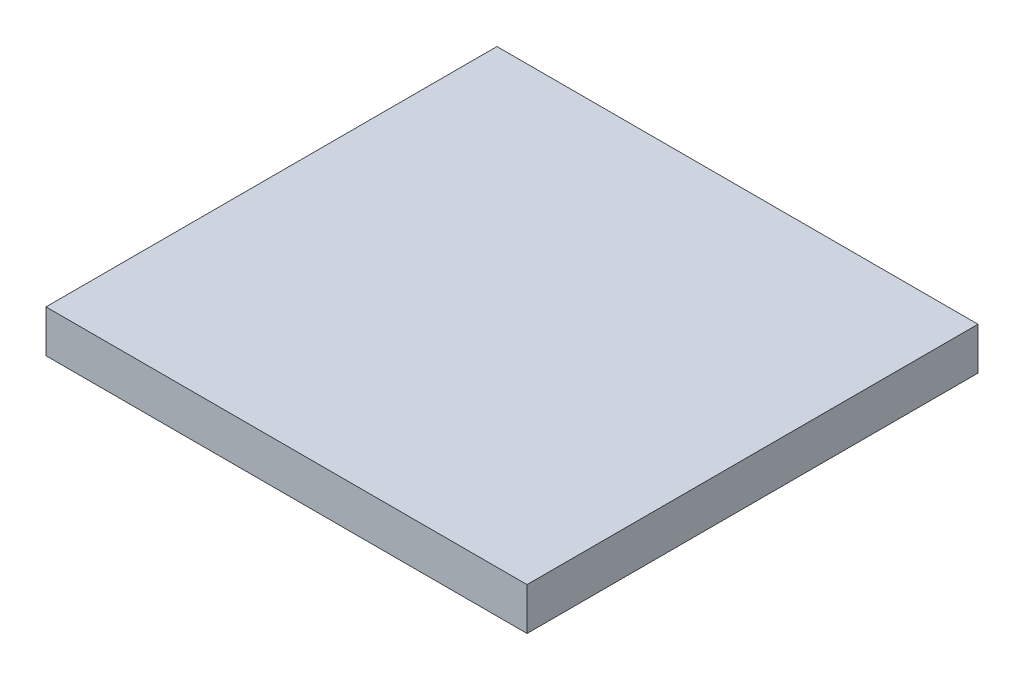
ISO-10303-21;
HEADER;
FILE_DESCRIPTION(('STEP AP214'),'2;1');
FILE_NAME('part.step','',(''),(''),'','','');
FILE_SCHEMA(('AUTOMOTIVE_DESIGN { 1 0 10303 214 1 1 1 1 }'));
ENDSEC;
DATA;
#1=APPLICATION_CONTEXT('core data for automotive mechanical design processes');
#2=APPLICATION_PROTOCOL_DEFINITION('international standard','automotive_design',2000,#1);
#3=PRODUCT_CONTEXT('',#1,'mechanical');
#4=PRODUCT('Part','Part','',(#3));
#5=PRODUCT_RELATED_PRODUCT_CATEGORY('part','',(#4));
#6=PRODUCT_DEFINITION_FORMATION('','',#4);
#7=PRODUCT_DEFINITION_CONTEXT('part definition',#1,'design');
#8=PRODUCT_DEFINITION('design','',#6,#7);
#9=PRODUCT_DEFINITION_SHAPE('','',#8);
#10=(LENGTH_UNIT() NAMED_UNIT(*) SI_UNIT(.MILLI.,.METRE.));
#11=(NAMED_UNIT(*) PLANE_ANGLE_UNIT() SI_UNIT($,.RADIAN.));
#12=(NAMED_UNIT(*) SI_UNIT($,.STERADIAN.) SOLID_ANGLE_UNIT());
#13=UNCERTAINTY_MEASURE_WITH_UNIT(LENGTH_MEASURE(1.E-05),#10,'distance_accuracy_value','');
#14=(GEOMETRIC_REPRESENTATION_CONTEXT(3) GLOBAL_UNCERTAINTY_ASSIGNED_CONTEXT((#13)) GLOBAL_UNIT_ASSIGNED_CONTEXT((#10,
#11,#12)) REPRESENTATION_CONTEXT('',''));
#15=CARTESIAN_POINT('',(0.,0.,0.));
#16=DIRECTION('',(0.,0.,1.));
#17=DIRECTION('',(1.,0.,0.));
#18=AXIS2_PLACEMENT_3D('',#15,#16,#17);
#19=CARTESIAN_POINT('',(-23292.1984011945,5494.86880151477,41169.208590158));
#20=DIRECTION('',(0.,0.,-1.));
#21=DIRECTION('',(-1.,0.,0.));
#22=AXIS2_PLACEMENT_3D('',#19,#20,#21);
#23=PLANE('',#22);
#24=DIRECTION('',(1.,0.,0.));
#25=VECTOR('',#24,1.);
#26=CARTESIAN_POINT('',(-23292.1984011945,5474.86880151477,41169.208590158));
#27=LINE('',#26,#25);
#28=CARTESIAN_POINT('',(-23399.2313777022,5474.86880151477,41169.208590158));
#29=VERTEX_POINT('',#28);
#30=CARTESIAN_POINT('',(-23172.0164888801,5474.86880151477,41169.208590158));
#31=VERTEX_POINT('',#30);
#32=EDGE_CURVE('E101',#29,#31,#27,.T.);
#33=ORIENTED_EDGE('',*,*,#32,.F.);
#34=DIRECTION('',(0.,-1.,0.));
#35=VECTOR('',#34,1.);
#36=CARTESIAN_POINT('',(-23399.2313777022,5494.86880151477,41169.208590158));
#37=LINE('',#36,#35);
#38=CARTESIAN_POINT('',(-23399.2313777022,5494.86880151477,41169.208590158));
#39=VERTEX_POINT('',#38);
#40=EDGE_CURVE('E11',#39,#29,#37,.T.);
#41=ORIENTED_EDGE('',*,*,#40,.F.);
#42=DIRECTION('',(1.,0.,0.));
#43=VECTOR('',#42,1.);
#44=CARTESIAN_POINT('',(-23292.1984011945,5494.86880151477,41169.208590158));
#45=LINE('',#44,#43);
#46=CARTESIAN_POINT('',(-23172.0164888801,5494.86880151477,41169.208590158));
#47=VERTEX_POINT('',#46);
#48=EDGE_CURVE('E95',#39,#47,#45,.T.);
#49=ORIENTED_EDGE('',*,*,#48,.T.);
#50=DIRECTION('',(0.,-1.,0.));
#51=VECTOR('',#50,1.);
#52=CARTESIAN_POINT('',(-23172.0164888801,5494.86880151477,41169.208590158));
#53=LINE('',#52,#51);
#54=EDGE_CURVE('E40',#47,#31,#53,.T.);
#55=ORIENTED_EDGE('',*,*,#54,.T.);
#56=EDGE_LOOP('',(#33,#41,#49,#55));
#57=FACE_BOUND('',#56,.T.);
#58=ADVANCED_FACE('F37',(#57),#23,.T.);
#59=CARTESIAN_POINT('',(-23399.2313777022,5494.86880151475,41549.6514742169));
#60=DIRECTION('',(-1.,0.,0.));
#61=DIRECTION('',(0.,0.,1.));
#62=AXIS2_PLACEMENT_3D('',#59,#60,#61);
#63=PLANE('',#62);
#64=DIRECTION('',(0.,0.,-1.));
#65=VECTOR('',#64,1.);
#66=CARTESIAN_POINT('',(-23399.2313777022,5474.86880151475,41549.6514742169));
#67=LINE('',#66,#65);
#68=CARTESIAN_POINT('',(-23399.2313777022,5474.86880151476,41382.2225484287));
#69=VERTEX_POINT('',#68);
#70=EDGE_CURVE('E97',#69,#29,#67,.T.);
#71=ORIENTED_EDGE('',*,*,#70,.F.);
#72=DIRECTION('',(0.,-1.,0.));
#73=VECTOR('',#72,1.);
#74=CARTESIAN_POINT('',(-23399.2313777022,5494.86880151476,41382.2225484287));
#75=LINE('',#74,#73);
#76=CARTESIAN_POINT('',(-23399.2313777022,5494.86880151476,41382.2225484287));
#77=VERTEX_POINT('',#76);
#78=EDGE_CURVE('E46',#77,#69,#75,.T.);
#79=ORIENTED_EDGE('',*,*,#78,.F.);
#80=DIRECTION('',(0.,0.,-1.));
#81=VECTOR('',#80,1.);
#82=CARTESIAN_POINT('',(-23399.2313777022,5494.86880151475,41549.6514742169));
#83=LINE('',#82,#81);
#84=EDGE_CURVE('E92',#77,#39,#83,.T.);
#85=ORIENTED_EDGE('',*,*,#84,.T.);
#86=ORIENTED_EDGE('',*,*,#40,.T.);
#87=EDGE_LOOP('',(#71,#79,#85,#86));
#88=FACE_BOUND('',#87,.T.);
#89=ADVANCED_FACE('F111',(#88),#63,.T.);
#90=CARTESIAN_POINT('',(-23292.1984011945,5494.86880151476,41382.2225484287));
#91=DIRECTION('',(0.,0.,1.));
#92=DIRECTION('',(1.,0.,0.));
#93=AXIS2_PLACEMENT_3D('',#90,#91,#92);
#94=PLANE('',#93);
#95=DIRECTION('',(-1.,0.,0.));
#96=VECTOR('',#95,1.);
#97=CARTESIAN_POINT('',(-23292.1984011945,5474.86880151476,41382.2225484287));
#98=LINE('',#97,#96);
#99=CARTESIAN_POINT('',(-23172.0164888801,5474.86880151476,41382.2225484287));
#100=VERTEX_POINT('',#99);
#101=EDGE_CURVE('E87',#100,#69,#98,.T.);
#102=ORIENTED_EDGE('',*,*,#101,.F.);
#103=DIRECTION('',(0.,-1.,0.));
#104=VECTOR('',#103,1.);
#105=CARTESIAN_POINT('',(-23172.0164888801,5494.86880151476,41382.2225484287));
#106=LINE('',#105,#104);
#107=CARTESIAN_POINT('',(-23172.0164888801,5494.86880151476,41382.2225484287));
#108=VERTEX_POINT('',#107);
#109=EDGE_CURVE('E82',#108,#100,#106,.T.);
#110=ORIENTED_EDGE('',*,*,#109,.F.);
#111=DIRECTION('',(-1.,0.,0.));
#112=VECTOR('',#111,1.);
#113=CARTESIAN_POINT('',(-23292.1984011945,5494.86880151476,41382.2225484287));
#114=LINE('',#113,#112);
#115=EDGE_CURVE('E85',#108,#77,#114,.T.);
#116=ORIENTED_EDGE('',*,*,#115,.T.);
#117=ORIENTED_EDGE('',*,*,#78,.T.);
#118=EDGE_LOOP('',(#102,#110,#116,#117));
#119=FACE_BOUND('',#118,.T.);
#120=ADVANCED_FACE('F84',(#119),#94,.T.);
#121=CARTESIAN_POINT('',(-23172.0164888801,5494.86880151475,41549.6514742169));
#122=DIRECTION('',(1.,0.,0.));
#123=DIRECTION('',(0.,0.,-1.));
#124=AXIS2_PLACEMENT_3D('',#121,#122,#123);
#125=PLANE('',#124);
#126=DIRECTION('',(0.,0.,1.));
#127=VECTOR('',#126,1.);
#128=CARTESIAN_POINT('',(-23172.0164888801,5474.86880151475,41549.6514742169));
#129=LINE('',#128,#127);
#130=EDGE_CURVE('E104',#31,#100,#129,.T.);
#131=ORIENTED_EDGE('',*,*,#130,.F.);
#132=ORIENTED_EDGE('',*,*,#54,.F.);
#133=DIRECTION('',(0.,0.,1.));
#134=VECTOR('',#133,1.);
#135=CARTESIAN_POINT('',(-23172.0164888801,5494.86880151475,41549.6514742169));
#136=LINE('',#135,#134);
#137=EDGE_CURVE('E91',#47,#108,#136,.T.);
#138=ORIENTED_EDGE('',*,*,#137,.T.);
#139=ORIENTED_EDGE('',*,*,#109,.T.);
#140=EDGE_LOOP('',(#131,#132,#138,#139));
#141=FACE_BOUND('',#140,.T.);
#142=ADVANCED_FACE('F94',(#141),#125,.T.);
#143=CARTESIAN_POINT('',(-1.25810477292866E-11,5494.86880151708,3.00098583329093E-10));
#144=DIRECTION('',(0.,-1.,0.));
#145=DIRECTION('',(0.,0.,-1.));
#146=AXIS2_PLACEMENT_3D('',#143,#144,#145);
#147=PLANE('',#146);
#148=ORIENTED_EDGE('',*,*,#48,.F.);
#149=ORIENTED_EDGE('',*,*,#84,.F.);
#150=ORIENTED_EDGE('',*,*,#115,.F.);
#151=ORIENTED_EDGE('',*,*,#137,.F.);
#152=EDGE_LOOP('',(#148,#149,#150,#151));
#153=FACE_BOUND('',#152,.T.);
#154=ADVANCED_FACE('F90',(#153),#147,.F.);
#155=CARTESIAN_POINT('',(-1.25810477292866E-11,5474.86880151708,3.00098583329093E-10));
#156=DIRECTION('',(0.,-1.,0.));
#157=DIRECTION('',(0.,0.,-1.));
#158=AXIS2_PLACEMENT_3D('',#155,#156,#157);
#159=PLANE('',#158);
#160=ORIENTED_EDGE('',*,*,#32,.T.);
#161=ORIENTED_EDGE('',*,*,#130,.T.);
#162=ORIENTED_EDGE('',*,*,#101,.T.);
#163=ORIENTED_EDGE('',*,*,#70,.T.);
#164=EDGE_LOOP('',(#160,#161,#162,#163));
#165=FACE_BOUND('',#164,.T.);
#166=ADVANCED_FACE('F110',(#165),#159,.T.);
#167=CLOSED_SHELL('',(#58,#89,#120,#142,#154,#166));
#168=MANIFOLD_SOLID_BREP('B2',#167);
#169=ADVANCED_BREP_SHAPE_REPRESENTATION('',(#18,#168),#14);
#170=SHAPE_DEFINITION_REPRESENTATION(#9,#169);
ENDSEC;
END-ISO-10303-21;
